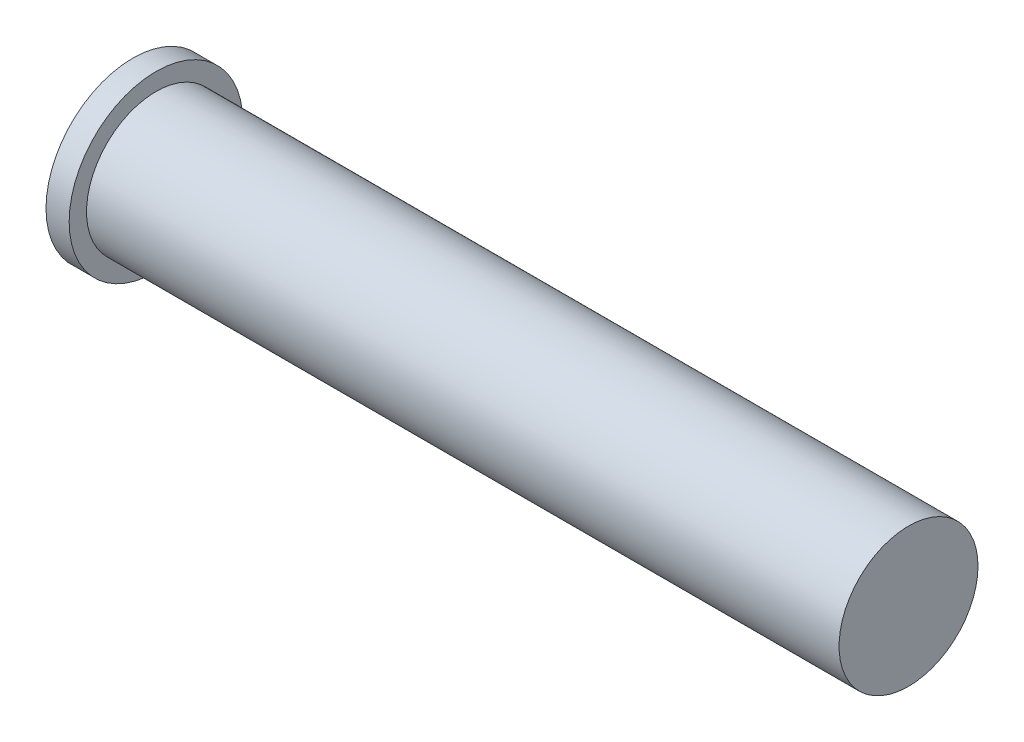
ISO-10303-21;
HEADER;
FILE_DESCRIPTION(('STEP AP214'),'2;1');
FILE_NAME('part.step','',(''),(''),'','','');
FILE_SCHEMA(('AUTOMOTIVE_DESIGN { 1 0 10303 214 1 1 1 1 }'));
ENDSEC;
DATA;
#1=APPLICATION_CONTEXT('core data for automotive mechanical design processes');
#2=APPLICATION_PROTOCOL_DEFINITION('international standard','automotive_design',2000,#1);
#3=PRODUCT_CONTEXT('',#1,'mechanical');
#4=PRODUCT('Part','Part','',(#3));
#5=PRODUCT_RELATED_PRODUCT_CATEGORY('part','',(#4));
#6=PRODUCT_DEFINITION_FORMATION('','',#4);
#7=PRODUCT_DEFINITION_CONTEXT('part definition',#1,'design');
#8=PRODUCT_DEFINITION('design','',#6,#7);
#9=PRODUCT_DEFINITION_SHAPE('','',#8);
#10=(LENGTH_UNIT() NAMED_UNIT(*) SI_UNIT(.MILLI.,.METRE.));
#11=(NAMED_UNIT(*) PLANE_ANGLE_UNIT() SI_UNIT($,.RADIAN.));
#12=(NAMED_UNIT(*) SI_UNIT($,.STERADIAN.) SOLID_ANGLE_UNIT());
#13=UNCERTAINTY_MEASURE_WITH_UNIT(LENGTH_MEASURE(1.E-05),#10,'distance_accuracy_value','');
#14=(GEOMETRIC_REPRESENTATION_CONTEXT(3) GLOBAL_UNCERTAINTY_ASSIGNED_CONTEXT((#13)) GLOBAL_UNIT_ASSIGNED_CONTEXT((#10,
#11,#12)) REPRESENTATION_CONTEXT('',''));
#15=CARTESIAN_POINT('',(0.,0.,0.));
#16=DIRECTION('',(0.,0.,1.));
#17=DIRECTION('',(1.,0.,0.));
#18=AXIS2_PLACEMENT_3D('',#15,#16,#17);
#19=CARTESIAN_POINT('',(2.,0.,0.));
#20=DIRECTION('',(-1.,0.,0.));
#21=DIRECTION('',(0.,0.,1.));
#22=AXIS2_PLACEMENT_3D('',#19,#20,#21);
#23=CYLINDRICAL_SURFACE('',#22,7.5);
#24=CARTESIAN_POINT('',(2.,0.,0.));
#25=DIRECTION('',(1.,0.,0.));
#26=DIRECTION('',(0.,0.,-1.));
#27=AXIS2_PLACEMENT_3D('',#24,#25,#26);
#28=CIRCLE('',#27,7.5);
#29=CARTESIAN_POINT('',(2.,0.,-7.5));
#30=VERTEX_POINT('',#29);
#31=EDGE_CURVE('E10',#30,#30,#28,.T.);
#32=ORIENTED_EDGE('',*,*,#31,.F.);
#33=EDGE_LOOP('',(#32));
#34=FACE_BOUND('',#33,.T.);
#35=CARTESIAN_POINT('',(0.,0.,0.));
#36=DIRECTION('',(1.,0.,0.));
#37=DIRECTION('',(0.,0.,-1.));
#38=AXIS2_PLACEMENT_3D('',#35,#36,#37);
#39=CIRCLE('',#38,7.5);
#40=CARTESIAN_POINT('',(0.,0.,-7.5));
#41=VERTEX_POINT('',#40);
#42=EDGE_CURVE('E40',#41,#41,#39,.T.);
#43=ORIENTED_EDGE('',*,*,#42,.T.);
#44=EDGE_LOOP('',(#43));
#45=FACE_BOUND('',#44,.T.);
#46=ADVANCED_FACE('F37',(#34,#45),#23,.T.);
#47=CARTESIAN_POINT('',(2.,0.,0.));
#48=DIRECTION('',(1.,0.,0.));
#49=DIRECTION('',(0.,0.,-1.));
#50=AXIS2_PLACEMENT_3D('',#47,#48,#49);
#51=PLANE('',#50);
#52=CARTESIAN_POINT('',(2.,0.,0.));
#53=DIRECTION('',(1.,0.,0.));
#54=DIRECTION('',(0.,0.,-1.));
#55=AXIS2_PLACEMENT_3D('',#52,#53,#54);
#56=CIRCLE('',#55,6.);
#57=CARTESIAN_POINT('',(2.,0.,-6.));
#58=VERTEX_POINT('',#57);
#59=EDGE_CURVE('E45',#58,#58,#56,.T.);
#60=ORIENTED_EDGE('',*,*,#59,.F.);
#61=EDGE_LOOP('',(#60));
#62=FACE_BOUND('',#61,.T.);
#63=ORIENTED_EDGE('',*,*,#31,.T.);
#64=EDGE_LOOP('',(#63));
#65=FACE_BOUND('',#64,.T.);
#66=ADVANCED_FACE('F65',(#62,#65),#51,.T.);
#67=CARTESIAN_POINT('',(0.,0.,0.));
#68=DIRECTION('',(1.,0.,0.));
#69=DIRECTION('',(0.,0.,-1.));
#70=AXIS2_PLACEMENT_3D('',#67,#68,#69);
#71=PLANE('',#70);
#72=ORIENTED_EDGE('',*,*,#42,.F.);
#73=EDGE_LOOP('',(#72));
#74=FACE_BOUND('',#73,.T.);
#75=ADVANCED_FACE('F62',(#74),#71,.F.);
#76=CARTESIAN_POINT('',(67.,0.,0.));
#77=DIRECTION('',(-1.,0.,0.));
#78=DIRECTION('',(0.,0.,1.));
#79=AXIS2_PLACEMENT_3D('',#76,#77,#78);
#80=CYLINDRICAL_SURFACE('',#79,6.);
#81=ORIENTED_EDGE('',*,*,#59,.T.);
#82=EDGE_LOOP('',(#81));
#83=FACE_BOUND('',#82,.T.);
#84=CARTESIAN_POINT('',(67.,0.,0.));
#85=DIRECTION('',(1.,0.,0.));
#86=DIRECTION('',(0.,0.,-1.));
#87=AXIS2_PLACEMENT_3D('',#84,#85,#86);
#88=CIRCLE('',#87,6.);
#89=CARTESIAN_POINT('',(67.,0.,-6.));
#90=VERTEX_POINT('',#89);
#91=EDGE_CURVE('E52',#90,#90,#88,.T.);
#92=ORIENTED_EDGE('',*,*,#91,.F.);
#93=EDGE_LOOP('',(#92));
#94=FACE_BOUND('',#93,.T.);
#95=ADVANCED_FACE('F64',(#83,#94),#80,.T.);
#96=CARTESIAN_POINT('',(67.,0.,0.));
#97=DIRECTION('',(1.,0.,0.));
#98=DIRECTION('',(0.,0.,-1.));
#99=AXIS2_PLACEMENT_3D('',#96,#97,#98);
#100=PLANE('',#99);
#101=ORIENTED_EDGE('',*,*,#91,.T.);
#102=EDGE_LOOP('',(#101));
#103=FACE_BOUND('',#102,.T.);
#104=ADVANCED_FACE('F70',(#103),#100,.T.);
#105=CLOSED_SHELL('',(#46,#66,#75,#95,#104));
#106=MANIFOLD_SOLID_BREP('B2',#105);
#107=ADVANCED_BREP_SHAPE_REPRESENTATION('',(#18,#106),#14);
#108=SHAPE_DEFINITION_REPRESENTATION(#9,#107);
ENDSEC;
END-ISO-10303-21;
